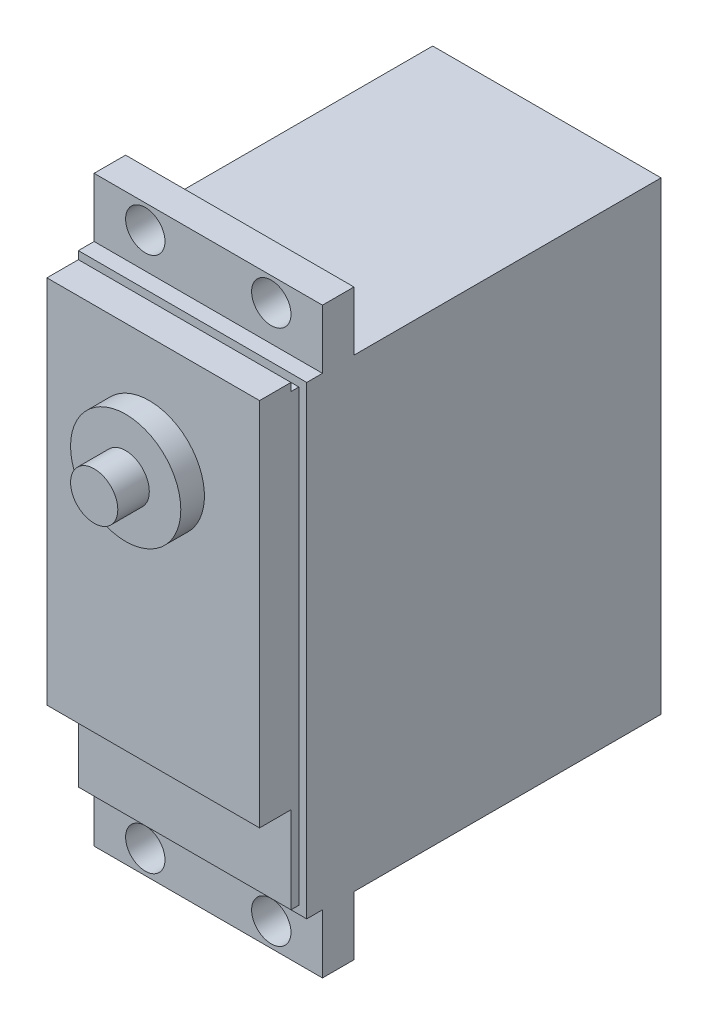
ISO-10303-21;
HEADER;
FILE_DESCRIPTION(('STEP AP214'),'2;1');
FILE_NAME('part.step','',(''),(''),'','','');
FILE_SCHEMA(('AUTOMOTIVE_DESIGN { 1 0 10303 214 1 1 1 1 }'));
ENDSEC;
DATA;
#1=APPLICATION_CONTEXT('core data for automotive mechanical design processes');
#2=APPLICATION_PROTOCOL_DEFINITION('international standard','automotive_design',2000,#1);
#3=PRODUCT_CONTEXT('',#1,'mechanical');
#4=PRODUCT('Part','Part','',(#3));
#5=PRODUCT_RELATED_PRODUCT_CATEGORY('part','',(#4));
#6=PRODUCT_DEFINITION_FORMATION('','',#4);
#7=PRODUCT_DEFINITION_CONTEXT('part definition',#1,'design');
#8=PRODUCT_DEFINITION('design','',#6,#7);
#9=PRODUCT_DEFINITION_SHAPE('','',#8);
#10=(LENGTH_UNIT() NAMED_UNIT(*) SI_UNIT(.MILLI.,.METRE.));
#11=(NAMED_UNIT(*) PLANE_ANGLE_UNIT() SI_UNIT($,.RADIAN.));
#12=(NAMED_UNIT(*) SI_UNIT($,.STERADIAN.) SOLID_ANGLE_UNIT());
#13=UNCERTAINTY_MEASURE_WITH_UNIT(LENGTH_MEASURE(1.E-05),#10,'distance_accuracy_value','');
#14=(GEOMETRIC_REPRESENTATION_CONTEXT(3) GLOBAL_UNCERTAINTY_ASSIGNED_CONTEXT((#13)) GLOBAL_UNIT_ASSIGNED_CONTEXT((#10,
#11,#12)) REPRESENTATION_CONTEXT('',''));
#15=CARTESIAN_POINT('',(0.,0.,0.));
#16=DIRECTION('',(0.,0.,1.));
#17=DIRECTION('',(1.,0.,0.));
#18=AXIS2_PLACEMENT_3D('',#15,#16,#17);
#19=CARTESIAN_POINT('',(0.,0.,45.));
#20=DIRECTION('',(0.,0.,1.));
#21=DIRECTION('',(1.,0.,0.));
#22=AXIS2_PLACEMENT_3D('',#19,#20,#21);
#23=PLANE('',#22);
#24=DIRECTION('',(0.,-1.,0.));
#25=VECTOR('',#24,1.);
#26=CARTESIAN_POINT('',(-59.1299970676006,19.3990717863914,45.));
#27=LINE('',#26,#25);
#28=CARTESIAN_POINT('',(-59.1299970676006,19.3990717863914,45.));
#29=VERTEX_POINT('',#28);
#30=CARTESIAN_POINT('',(-59.1299970676006,-39.6009282136086,45.));
#31=VERTEX_POINT('',#30);
#32=EDGE_CURVE('E228',#29,#31,#27,.T.);
#33=ORIENTED_EDGE('',*,*,#32,.T.);
#34=DIRECTION('',(1.,0.,0.));
#35=VECTOR('',#34,1.);
#36=CARTESIAN_POINT('',(-59.1299970676006,-39.6009282136086,45.));
#37=LINE('',#36,#35);
#38=CARTESIAN_POINT('',(-30.1299970676006,-39.6009282136086,45.));
#39=VERTEX_POINT('',#38);
#40=EDGE_CURVE('E231',#31,#39,#37,.T.);
#41=ORIENTED_EDGE('',*,*,#40,.T.);
#42=DIRECTION('',(0.,1.,0.));
#43=VECTOR('',#42,1.);
#44=CARTESIAN_POINT('',(-30.1299970676006,19.3990717863914,45.));
#45=LINE('',#44,#43);
#46=CARTESIAN_POINT('',(-30.1299970676006,19.3990717863914,45.));
#47=VERTEX_POINT('',#46);
#48=EDGE_CURVE('E234',#39,#47,#45,.T.);
#49=ORIENTED_EDGE('',*,*,#48,.T.);
#50=DIRECTION('',(-1.,0.,0.));
#51=VECTOR('',#50,1.);
#52=CARTESIAN_POINT('',(-59.1299970676006,19.3990717863914,45.));
#53=LINE('',#52,#51);
#54=EDGE_CURVE('E236',#47,#29,#53,.T.);
#55=ORIENTED_EDGE('',*,*,#54,.T.);
#56=EDGE_LOOP('',(#33,#41,#49,#55));
#57=FACE_BOUND('',#56,.T.);
#58=DIRECTION('',(1.,0.,0.));
#59=VECTOR('',#58,1.);
#60=CARTESIAN_POINT('',(-58.1299970676006,-38.6009282136086,45.));
#61=LINE('',#60,#59);
#62=CARTESIAN_POINT('',(-58.1299970676006,-38.6009282136086,45.));
#63=VERTEX_POINT('',#62);
#64=CARTESIAN_POINT('',(-31.1299970676006,-38.6009282136086,45.));
#65=VERTEX_POINT('',#64);
#66=EDGE_CURVE('E196',#63,#65,#61,.T.);
#67=ORIENTED_EDGE('',*,*,#66,.F.);
#68=DIRECTION('',(0.,-1.,0.));
#69=VECTOR('',#68,1.);
#70=CARTESIAN_POINT('',(-58.1299970676006,18.3990717863914,45.));
#71=LINE('',#70,#69);
#72=CARTESIAN_POINT('',(-58.1299970676006,18.3990717863914,45.));
#73=VERTEX_POINT('',#72);
#74=EDGE_CURVE('E194',#73,#63,#71,.T.);
#75=ORIENTED_EDGE('',*,*,#74,.F.);
#76=DIRECTION('',(-1.,0.,0.));
#77=VECTOR('',#76,1.);
#78=CARTESIAN_POINT('',(-58.1299970676006,18.3990717863914,45.));
#79=LINE('',#78,#77);
#80=CARTESIAN_POINT('',(-31.1299970676006,18.3990717863914,45.));
#81=VERTEX_POINT('',#80);
#82=EDGE_CURVE('E220',#81,#73,#79,.T.);
#83=ORIENTED_EDGE('',*,*,#82,.F.);
#84=DIRECTION('',(0.,1.,0.));
#85=VECTOR('',#84,1.);
#86=CARTESIAN_POINT('',(-31.1299970676006,18.3990717863914,45.));
#87=LINE('',#86,#85);
#88=EDGE_CURVE('E218',#65,#81,#87,.T.);
#89=ORIENTED_EDGE('',*,*,#88,.F.);
#90=EDGE_LOOP('',(#67,#75,#83,#89));
#91=FACE_BOUND('',#90,.T.);
#92=ADVANCED_FACE('F32',(#57,#91),#23,.T.);
#93=CARTESIAN_POINT('',(0.,0.,43.));
#94=DIRECTION('',(0.,0.,1.));
#95=DIRECTION('',(1.,0.,0.));
#96=AXIS2_PLACEMENT_3D('',#93,#94,#95);
#97=PLANE('',#96);
#98=CARTESIAN_POINT('',(-52.6299970676006,23.8990717863912,43.));
#99=DIRECTION('',(0.,0.,1.));
#100=DIRECTION('',(1.,0.,0.));
#101=AXIS2_PLACEMENT_3D('',#98,#99,#100);
#102=CIRCLE('',#101,2.5);
#103=CARTESIAN_POINT('',(-50.1299970676006,23.8990717863912,43.));
#104=VERTEX_POINT('',#103);
#105=EDGE_CURVE('E494',#104,#104,#102,.T.);
#106=ORIENTED_EDGE('',*,*,#105,.F.);
#107=EDGE_LOOP('',(#106));
#108=FACE_BOUND('',#107,.T.);
#109=CARTESIAN_POINT('',(-36.6299970676006,23.8990717863914,43.));
#110=DIRECTION('',(0.,0.,1.));
#111=DIRECTION('',(1.,0.,0.));
#112=AXIS2_PLACEMENT_3D('',#109,#110,#111);
#113=CIRCLE('',#112,2.5);
#114=CARTESIAN_POINT('',(-34.1299970676006,23.8990717863914,43.));
#115=VERTEX_POINT('',#114);
#116=EDGE_CURVE('E486',#115,#115,#113,.T.);
#117=ORIENTED_EDGE('',*,*,#116,.F.);
#118=EDGE_LOOP('',(#117));
#119=FACE_BOUND('',#118,.T.);
#120=DIRECTION('',(-1.,0.,0.));
#121=VECTOR('',#120,1.);
#122=CARTESIAN_POINT('',(-59.1299970676006,19.3990717863914,43.));
#123=LINE('',#122,#121);
#124=CARTESIAN_POINT('',(-30.1299970676006,19.3990717863914,43.));
#125=VERTEX_POINT('',#124);
#126=CARTESIAN_POINT('',(-59.1299970676006,19.3990717863914,43.));
#127=VERTEX_POINT('',#126);
#128=EDGE_CURVE('E232',#125,#127,#123,.T.);
#129=ORIENTED_EDGE('',*,*,#128,.F.);
#130=DIRECTION('',(0.,1.,0.));
#131=VECTOR('',#130,1.);
#132=CARTESIAN_POINT('',(-30.1299970676006,19.3990717863914,43.));
#133=LINE('',#132,#131);
#134=CARTESIAN_POINT('',(-30.1299970676006,26.8990717863914,43.));
#135=VERTEX_POINT('',#134);
#136=EDGE_CURVE('E247',#125,#135,#133,.T.);
#137=ORIENTED_EDGE('',*,*,#136,.T.);
#138=DIRECTION('',(-1.,0.,0.));
#139=VECTOR('',#138,1.);
#140=CARTESIAN_POINT('',(-59.1299970676006,26.8990717863914,43.));
#141=LINE('',#140,#139);
#142=CARTESIAN_POINT('',(-59.1299970676006,26.8990717863914,43.));
#143=VERTEX_POINT('',#142);
#144=EDGE_CURVE('E421',#135,#143,#141,.T.);
#145=ORIENTED_EDGE('',*,*,#144,.T.);
#146=DIRECTION('',(0.,-1.,0.));
#147=VECTOR('',#146,1.);
#148=CARTESIAN_POINT('',(-59.1299970676006,19.3990717863914,43.));
#149=LINE('',#148,#147);
#150=EDGE_CURVE('E400',#143,#127,#149,.T.);
#151=ORIENTED_EDGE('',*,*,#150,.T.);
#152=EDGE_LOOP('',(#129,#137,#145,#151));
#153=FACE_BOUND('',#152,.T.);
#154=ADVANCED_FACE('F329',(#108,#119,#153),#97,.T.);
#155=CARTESIAN_POINT('',(-59.1299970676006,19.3990717863914,43.));
#156=DIRECTION('',(1.,0.,0.));
#157=DIRECTION('',(0.,0.,-1.));
#158=AXIS2_PLACEMENT_3D('',#155,#156,#157);
#159=PLANE('',#158);
#160=DIRECTION('',(0.,0.,-1.));
#161=VECTOR('',#160,1.);
#162=CARTESIAN_POINT('',(-59.1299970676006,-39.6009282136086,43.));
#163=LINE('',#162,#161);
#164=CARTESIAN_POINT('',(-59.1299970676006,-39.6009282136086,39.));
#165=VERTEX_POINT('',#164);
#166=CARTESIAN_POINT('',(-59.1299970676006,-39.6009282136086,0.));
#167=VERTEX_POINT('',#166);
#168=EDGE_CURVE('E390',#165,#167,#163,.T.);
#169=ORIENTED_EDGE('',*,*,#168,.F.);
#170=DIRECTION('',(0.,-1.,0.));
#171=VECTOR('',#170,1.);
#172=CARTESIAN_POINT('',(-59.1299970676006,-47.1009282136086,39.));
#173=LINE('',#172,#171);
#174=CARTESIAN_POINT('',(-59.1299970676006,-47.1009282136086,39.));
#175=VERTEX_POINT('',#174);
#176=EDGE_CURVE('E433',#165,#175,#173,.T.);
#177=ORIENTED_EDGE('',*,*,#176,.T.);
#178=DIRECTION('',(0.,0.,1.));
#179=VECTOR('',#178,1.);
#180=CARTESIAN_POINT('',(-59.1299970676006,-47.1009282136086,39.));
#181=LINE('',#180,#179);
#182=CARTESIAN_POINT('',(-59.1299970676006,-47.1009282136086,43.));
#183=VERTEX_POINT('',#182);
#184=EDGE_CURVE('E441',#175,#183,#181,.T.);
#185=ORIENTED_EDGE('',*,*,#184,.T.);
#186=CARTESIAN_POINT('',(-59.1299970676006,-39.6009282136086,43.));
#187=VERTEX_POINT('',#186);
#188=EDGE_CURVE('E403',#187,#183,#149,.T.);
#189=ORIENTED_EDGE('',*,*,#188,.F.);
#190=DIRECTION('',(0.,0.,-1.));
#191=VECTOR('',#190,1.);
#192=CARTESIAN_POINT('',(-59.1299970676006,-39.6009282136086,45.));
#193=LINE('',#192,#191);
#194=EDGE_CURVE('E253',#31,#187,#193,.T.);
#195=ORIENTED_EDGE('',*,*,#194,.F.);
#196=ORIENTED_EDGE('',*,*,#32,.F.);
#197=DIRECTION('',(0.,0.,-1.));
#198=VECTOR('',#197,1.);
#199=CARTESIAN_POINT('',(-59.1299970676006,19.3990717863914,45.));
#200=LINE('',#199,#198);
#201=EDGE_CURVE('E238',#29,#127,#200,.T.);
#202=ORIENTED_EDGE('',*,*,#201,.T.);
#203=ORIENTED_EDGE('',*,*,#150,.F.);
#204=DIRECTION('',(0.,0.,1.));
#205=VECTOR('',#204,1.);
#206=CARTESIAN_POINT('',(-59.1299970676006,26.8990717863914,39.));
#207=LINE('',#206,#205);
#208=CARTESIAN_POINT('',(-59.1299970676006,26.8990717863914,39.));
#209=VERTEX_POINT('',#208);
#210=EDGE_CURVE('E429',#209,#143,#207,.T.);
#211=ORIENTED_EDGE('',*,*,#210,.F.);
#212=CARTESIAN_POINT('',(-59.1299970676006,19.3990717863914,39.));
#213=VERTEX_POINT('',#212);
#214=EDGE_CURVE('E435',#209,#213,#173,.T.);
#215=ORIENTED_EDGE('',*,*,#214,.T.);
#216=DIRECTION('',(0.,0.,-1.));
#217=VECTOR('',#216,1.);
#218=CARTESIAN_POINT('',(-59.1299970676006,19.3990717863914,43.));
#219=LINE('',#218,#217);
#220=CARTESIAN_POINT('',(-59.1299970676006,19.3990717863914,0.));
#221=VERTEX_POINT('',#220);
#222=EDGE_CURVE('E394',#213,#221,#219,.T.);
#223=ORIENTED_EDGE('',*,*,#222,.T.);
#224=DIRECTION('',(0.,-1.,0.));
#225=VECTOR('',#224,1.);
#226=CARTESIAN_POINT('',(-59.1299970676006,19.3990717863914,0.));
#227=LINE('',#226,#225);
#228=EDGE_CURVE('E410',#221,#167,#227,.T.);
#229=ORIENTED_EDGE('',*,*,#228,.T.);
#230=EDGE_LOOP('',(#169,#177,#185,#189,#195,#196,#202,#203,#211,#215,#223,#229));
#231=FACE_BOUND('',#230,.T.);
#232=ADVANCED_FACE('F34',(#231),#159,.F.);
#233=CARTESIAN_POINT('',(-59.1299970676006,-39.6009282136086,43.));
#234=DIRECTION('',(0.,1.,0.));
#235=DIRECTION('',(0.,0.,1.));
#236=AXIS2_PLACEMENT_3D('',#233,#234,#235);
#237=PLANE('',#236);
#238=DIRECTION('',(0.,0.,-1.));
#239=VECTOR('',#238,1.);
#240=CARTESIAN_POINT('',(-30.1299970676006,-39.6009282136086,43.));
#241=LINE('',#240,#239);
#242=CARTESIAN_POINT('',(-30.1299970676006,-39.6009282136086,39.));
#243=VERTEX_POINT('',#242);
#244=CARTESIAN_POINT('',(-30.1299970676006,-39.6009282136086,0.));
#245=VERTEX_POINT('',#244);
#246=EDGE_CURVE('E382',#243,#245,#241,.T.);
#247=ORIENTED_EDGE('',*,*,#246,.F.);
#248=DIRECTION('',(-1.,0.,0.));
#249=VECTOR('',#248,1.);
#250=CARTESIAN_POINT('',(-59.1299970676006,-39.6009282136086,39.));
#251=LINE('',#250,#249);
#252=EDGE_CURVE('E383',#243,#165,#251,.T.);
#253=ORIENTED_EDGE('',*,*,#252,.T.);
#254=ORIENTED_EDGE('',*,*,#168,.T.);
#255=DIRECTION('',(1.,0.,0.));
#256=VECTOR('',#255,1.);
#257=CARTESIAN_POINT('',(-59.1299970676006,-39.6009282136086,0.));
#258=LINE('',#257,#256);
#259=EDGE_CURVE('E386',#167,#245,#258,.T.);
#260=ORIENTED_EDGE('',*,*,#259,.T.);
#261=EDGE_LOOP('',(#247,#253,#254,#260));
#262=FACE_BOUND('',#261,.T.);
#263=ADVANCED_FACE('F371',(#262),#237,.F.);
#264=CARTESIAN_POINT('',(-30.1299970676006,19.3990717863914,43.));
#265=DIRECTION('',(-1.,0.,0.));
#266=DIRECTION('',(0.,0.,1.));
#267=AXIS2_PLACEMENT_3D('',#264,#265,#266);
#268=PLANE('',#267);
#269=DIRECTION('',(0.,0.,-1.));
#270=VECTOR('',#269,1.);
#271=CARTESIAN_POINT('',(-30.1299970676006,19.3990717863914,43.));
#272=LINE('',#271,#270);
#273=CARTESIAN_POINT('',(-30.1299970676006,19.3990717863914,39.));
#274=VERTEX_POINT('',#273);
#275=CARTESIAN_POINT('',(-30.1299970676006,19.3990717863914,0.));
#276=VERTEX_POINT('',#275);
#277=EDGE_CURVE('E391',#274,#276,#272,.T.);
#278=ORIENTED_EDGE('',*,*,#277,.F.);
#279=DIRECTION('',(0.,1.,0.));
#280=VECTOR('',#279,1.);
#281=CARTESIAN_POINT('',(-30.1299970676006,-47.1009282136086,39.));
#282=LINE('',#281,#280);
#283=CARTESIAN_POINT('',(-30.1299970676006,26.8990717863914,39.));
#284=VERTEX_POINT('',#283);
#285=EDGE_CURVE('E426',#274,#284,#282,.T.);
#286=ORIENTED_EDGE('',*,*,#285,.T.);
#287=DIRECTION('',(0.,0.,1.));
#288=VECTOR('',#287,1.);
#289=CARTESIAN_POINT('',(-30.1299970676006,26.8990717863914,39.));
#290=LINE('',#289,#288);
#291=EDGE_CURVE('E424',#284,#135,#290,.T.);
#292=ORIENTED_EDGE('',*,*,#291,.T.);
#293=ORIENTED_EDGE('',*,*,#136,.F.);
#294=DIRECTION('',(0.,0.,-1.));
#295=VECTOR('',#294,1.);
#296=CARTESIAN_POINT('',(-30.1299970676006,19.3990717863914,45.));
#297=LINE('',#296,#295);
#298=EDGE_CURVE('E254',#47,#125,#297,.T.);
#299=ORIENTED_EDGE('',*,*,#298,.F.);
#300=ORIENTED_EDGE('',*,*,#48,.F.);
#301=DIRECTION('',(0.,0.,-1.));
#302=VECTOR('',#301,1.);
#303=CARTESIAN_POINT('',(-30.1299970676006,-39.6009282136086,45.));
#304=LINE('',#303,#302);
#305=CARTESIAN_POINT('',(-30.1299970676006,-39.6009282136086,43.));
#306=VERTEX_POINT('',#305);
#307=EDGE_CURVE('E250',#39,#306,#304,.T.);
#308=ORIENTED_EDGE('',*,*,#307,.T.);
#309=CARTESIAN_POINT('',(-30.1299970676006,-47.1009282136086,43.));
#310=VERTEX_POINT('',#309);
#311=EDGE_CURVE('E413',#310,#306,#133,.T.);
#312=ORIENTED_EDGE('',*,*,#311,.F.);
#313=DIRECTION('',(0.,0.,1.));
#314=VECTOR('',#313,1.);
#315=CARTESIAN_POINT('',(-30.1299970676006,-47.1009282136086,39.));
#316=LINE('',#315,#314);
#317=CARTESIAN_POINT('',(-30.1299970676006,-47.1009282136086,39.));
#318=VERTEX_POINT('',#317);
#319=EDGE_CURVE('E430',#318,#310,#316,.T.);
#320=ORIENTED_EDGE('',*,*,#319,.F.);
#321=EDGE_CURVE('E447',#318,#243,#282,.T.);
#322=ORIENTED_EDGE('',*,*,#321,.T.);
#323=ORIENTED_EDGE('',*,*,#246,.T.);
#324=DIRECTION('',(0.,1.,0.));
#325=VECTOR('',#324,1.);
#326=CARTESIAN_POINT('',(-30.1299970676006,19.3990717863914,0.));
#327=LINE('',#326,#325);
#328=EDGE_CURVE('E461',#245,#276,#327,.T.);
#329=ORIENTED_EDGE('',*,*,#328,.T.);
#330=EDGE_LOOP('',(#278,#286,#292,#293,#299,#300,#308,#312,#320,#322,#323,#329));
#331=FACE_BOUND('',#330,.T.);
#332=ADVANCED_FACE('F368',(#331),#268,.F.);
#333=CARTESIAN_POINT('',(-59.1299970676006,19.3990717863914,43.));
#334=DIRECTION('',(0.,-1.,0.));
#335=DIRECTION('',(0.,0.,-1.));
#336=AXIS2_PLACEMENT_3D('',#333,#334,#335);
#337=PLANE('',#336);
#338=ORIENTED_EDGE('',*,*,#222,.F.);
#339=DIRECTION('',(1.,0.,0.));
#340=VECTOR('',#339,1.);
#341=CARTESIAN_POINT('',(-59.1299970676006,19.3990717863914,39.));
#342=LINE('',#341,#340);
#343=EDGE_CURVE('E40',#213,#274,#342,.T.);
#344=ORIENTED_EDGE('',*,*,#343,.T.);
#345=ORIENTED_EDGE('',*,*,#277,.T.);
#346=DIRECTION('',(-1.,0.,0.));
#347=VECTOR('',#346,1.);
#348=CARTESIAN_POINT('',(-59.1299970676006,19.3990717863914,0.));
#349=LINE('',#348,#347);
#350=EDGE_CURVE('E459',#276,#221,#349,.T.);
#351=ORIENTED_EDGE('',*,*,#350,.T.);
#352=EDGE_LOOP('',(#338,#344,#345,#351));
#353=FACE_BOUND('',#352,.T.);
#354=ADVANCED_FACE('F361',(#353),#337,.F.);
#355=CARTESIAN_POINT('',(-36.6299970675999,-44.1009282136086,43.));
#356=DIRECTION('',(0.,0.,1.));
#357=DIRECTION('',(1.,0.,0.));
#358=AXIS2_PLACEMENT_3D('',#355,#356,#357);
#359=CIRCLE('',#358,2.5);
#360=CARTESIAN_POINT('',(-34.1299970675999,-44.1009282136086,43.));
#361=VERTEX_POINT('',#360);
#362=EDGE_CURVE('E662',#361,#361,#359,.T.);
#363=ORIENTED_EDGE('',*,*,#362,.F.);
#364=EDGE_LOOP('',(#363));
#365=FACE_BOUND('',#364,.T.);
#366=CARTESIAN_POINT('',(-52.6299970675999,-44.1009282136088,43.));
#367=DIRECTION('',(0.,0.,1.));
#368=DIRECTION('',(1.,0.,0.));
#369=AXIS2_PLACEMENT_3D('',#366,#367,#368);
#370=CIRCLE('',#369,2.5);
#371=CARTESIAN_POINT('',(-50.1299970675999,-44.1009282136088,43.));
#372=VERTEX_POINT('',#371);
#373=EDGE_CURVE('E664',#372,#372,#370,.T.);
#374=ORIENTED_EDGE('',*,*,#373,.F.);
#375=EDGE_LOOP('',(#374));
#376=FACE_BOUND('',#375,.T.);
#377=DIRECTION('',(1.,0.,0.));
#378=VECTOR('',#377,1.);
#379=CARTESIAN_POINT('',(-59.1299970676006,-39.6009282136086,43.));
#380=LINE('',#379,#378);
#381=EDGE_CURVE('E227',#187,#306,#380,.T.);
#382=ORIENTED_EDGE('',*,*,#381,.F.);
#383=ORIENTED_EDGE('',*,*,#188,.T.);
#384=DIRECTION('',(1.,0.,0.));
#385=VECTOR('',#384,1.);
#386=CARTESIAN_POINT('',(-59.1299970676006,-47.1009282136086,43.));
#387=LINE('',#386,#385);
#388=EDGE_CURVE('E259',#183,#310,#387,.T.);
#389=ORIENTED_EDGE('',*,*,#388,.T.);
#390=ORIENTED_EDGE('',*,*,#311,.T.);
#391=EDGE_LOOP('',(#382,#383,#389,#390));
#392=FACE_BOUND('',#391,.T.);
#393=ADVANCED_FACE('F337',(#365,#376,#392),#97,.T.);
#394=CARTESIAN_POINT('',(0.,0.,0.));
#395=DIRECTION('',(0.,0.,1.));
#396=DIRECTION('',(1.,0.,0.));
#397=AXIS2_PLACEMENT_3D('',#394,#395,#396);
#398=PLANE('',#397);
#399=ORIENTED_EDGE('',*,*,#228,.F.);
#400=ORIENTED_EDGE('',*,*,#350,.F.);
#401=ORIENTED_EDGE('',*,*,#328,.F.);
#402=ORIENTED_EDGE('',*,*,#259,.F.);
#403=EDGE_LOOP('',(#399,#400,#401,#402));
#404=FACE_BOUND('',#403,.T.);
#405=ADVANCED_FACE('F355',(#404),#398,.F.);
#406=CARTESIAN_POINT('',(-59.1299970676006,26.8990717863914,39.));
#407=DIRECTION('',(0.,1.,0.));
#408=DIRECTION('',(0.,0.,1.));
#409=AXIS2_PLACEMENT_3D('',#406,#407,#408);
#410=PLANE('',#409);
#411=ORIENTED_EDGE('',*,*,#144,.F.);
#412=ORIENTED_EDGE('',*,*,#291,.F.);
#413=DIRECTION('',(-1.,0.,0.));
#414=VECTOR('',#413,1.);
#415=CARTESIAN_POINT('',(-59.1299970676006,26.8990717863914,39.));
#416=LINE('',#415,#414);
#417=EDGE_CURVE('E443',#284,#209,#416,.T.);
#418=ORIENTED_EDGE('',*,*,#417,.T.);
#419=ORIENTED_EDGE('',*,*,#210,.T.);
#420=EDGE_LOOP('',(#411,#412,#418,#419));
#421=FACE_BOUND('',#420,.T.);
#422=ADVANCED_FACE('F352',(#421),#410,.T.);
#423=CARTESIAN_POINT('',(0.,0.,39.));
#424=DIRECTION('',(0.,0.,-1.));
#425=DIRECTION('',(-1.,0.,0.));
#426=AXIS2_PLACEMENT_3D('',#423,#424,#425);
#427=PLANE('',#426);
#428=CARTESIAN_POINT('',(-52.6299970676006,23.8990717863912,39.));
#429=DIRECTION('',(0.,0.,1.));
#430=DIRECTION('',(1.,0.,0.));
#431=AXIS2_PLACEMENT_3D('',#428,#429,#430);
#432=CIRCLE('',#431,2.5);
#433=CARTESIAN_POINT('',(-50.1299970676006,23.8990717863912,39.));
#434=VERTEX_POINT('',#433);
#435=EDGE_CURVE('E480',#434,#434,#432,.T.);
#436=ORIENTED_EDGE('',*,*,#435,.T.);
#437=EDGE_LOOP('',(#436));
#438=FACE_BOUND('',#437,.T.);
#439=CARTESIAN_POINT('',(-36.6299970676006,23.8990717863914,39.));
#440=DIRECTION('',(0.,0.,1.));
#441=DIRECTION('',(1.,0.,0.));
#442=AXIS2_PLACEMENT_3D('',#439,#440,#441);
#443=CIRCLE('',#442,2.5);
#444=CARTESIAN_POINT('',(-34.1299970676006,23.8990717863914,39.));
#445=VERTEX_POINT('',#444);
#446=EDGE_CURVE('E483',#445,#445,#443,.T.);
#447=ORIENTED_EDGE('',*,*,#446,.T.);
#448=EDGE_LOOP('',(#447));
#449=FACE_BOUND('',#448,.T.);
#450=ORIENTED_EDGE('',*,*,#343,.F.);
#451=ORIENTED_EDGE('',*,*,#214,.F.);
#452=ORIENTED_EDGE('',*,*,#417,.F.);
#453=ORIENTED_EDGE('',*,*,#285,.F.);
#454=EDGE_LOOP('',(#450,#451,#452,#453));
#455=FACE_BOUND('',#454,.T.);
#456=ADVANCED_FACE('F350',(#438,#449,#455),#427,.T.);
#457=CARTESIAN_POINT('',(-36.6299970675999,-44.1009282136086,39.));
#458=DIRECTION('',(0.,0.,1.));
#459=DIRECTION('',(1.,0.,0.));
#460=AXIS2_PLACEMENT_3D('',#457,#458,#459);
#461=CIRCLE('',#460,2.5);
#462=CARTESIAN_POINT('',(-34.1299970675999,-44.1009282136086,39.));
#463=VERTEX_POINT('',#462);
#464=EDGE_CURVE('E659',#463,#463,#461,.T.);
#465=ORIENTED_EDGE('',*,*,#464,.T.);
#466=EDGE_LOOP('',(#465));
#467=FACE_BOUND('',#466,.T.);
#468=CARTESIAN_POINT('',(-52.6299970675999,-44.1009282136088,39.));
#469=DIRECTION('',(0.,0.,1.));
#470=DIRECTION('',(1.,0.,0.));
#471=AXIS2_PLACEMENT_3D('',#468,#469,#470);
#472=CIRCLE('',#471,2.5);
#473=CARTESIAN_POINT('',(-50.1299970675999,-44.1009282136088,39.));
#474=VERTEX_POINT('',#473);
#475=EDGE_CURVE('E667',#474,#474,#472,.T.);
#476=ORIENTED_EDGE('',*,*,#475,.T.);
#477=EDGE_LOOP('',(#476));
#478=FACE_BOUND('',#477,.T.);
#479=ORIENTED_EDGE('',*,*,#252,.F.);
#480=ORIENTED_EDGE('',*,*,#321,.F.);
#481=DIRECTION('',(1.,0.,0.));
#482=VECTOR('',#481,1.);
#483=CARTESIAN_POINT('',(-59.1299970676006,-47.1009282136086,39.));
#484=LINE('',#483,#482);
#485=EDGE_CURVE('E450',#175,#318,#484,.T.);
#486=ORIENTED_EDGE('',*,*,#485,.F.);
#487=ORIENTED_EDGE('',*,*,#176,.F.);
#488=EDGE_LOOP('',(#479,#480,#486,#487));
#489=FACE_BOUND('',#488,.T.);
#490=ADVANCED_FACE('F347',(#467,#478,#489),#427,.T.);
#491=CARTESIAN_POINT('',(-59.1299970676006,-47.1009282136086,39.));
#492=DIRECTION('',(0.,-1.,0.));
#493=DIRECTION('',(0.,0.,-1.));
#494=AXIS2_PLACEMENT_3D('',#491,#492,#493);
#495=PLANE('',#494);
#496=ORIENTED_EDGE('',*,*,#388,.F.);
#497=ORIENTED_EDGE('',*,*,#184,.F.);
#498=ORIENTED_EDGE('',*,*,#485,.T.);
#499=ORIENTED_EDGE('',*,*,#319,.T.);
#500=EDGE_LOOP('',(#496,#497,#498,#499));
#501=FACE_BOUND('',#500,.T.);
#502=ADVANCED_FACE('F345',(#501),#495,.T.);
#503=CARTESIAN_POINT('',(-59.1299970676006,-39.6009282136086,45.));
#504=DIRECTION('',(0.,1.,0.));
#505=DIRECTION('',(0.,0.,1.));
#506=AXIS2_PLACEMENT_3D('',#503,#504,#505);
#507=PLANE('',#506);
#508=ORIENTED_EDGE('',*,*,#381,.T.);
#509=ORIENTED_EDGE('',*,*,#307,.F.);
#510=ORIENTED_EDGE('',*,*,#40,.F.);
#511=ORIENTED_EDGE('',*,*,#194,.T.);
#512=EDGE_LOOP('',(#508,#509,#510,#511));
#513=FACE_BOUND('',#512,.T.);
#514=ADVANCED_FACE('F341',(#513),#507,.F.);
#515=CARTESIAN_POINT('',(-59.1299970676006,19.3990717863914,45.));
#516=DIRECTION('',(0.,-1.,0.));
#517=DIRECTION('',(0.,0.,-1.));
#518=AXIS2_PLACEMENT_3D('',#515,#516,#517);
#519=PLANE('',#518);
#520=ORIENTED_EDGE('',*,*,#128,.T.);
#521=ORIENTED_EDGE('',*,*,#201,.F.);
#522=ORIENTED_EDGE('',*,*,#54,.F.);
#523=ORIENTED_EDGE('',*,*,#298,.T.);
#524=EDGE_LOOP('',(#520,#521,#522,#523));
#525=FACE_BOUND('',#524,.T.);
#526=ADVANCED_FACE('F326',(#525),#519,.F.);
#527=CARTESIAN_POINT('',(-58.1299970676006,18.3990717863914,46.));
#528=DIRECTION('',(1.,0.,0.));
#529=DIRECTION('',(0.,0.,-1.));
#530=AXIS2_PLACEMENT_3D('',#527,#528,#529);
#531=PLANE('',#530);
#532=ORIENTED_EDGE('',*,*,#74,.T.);
#533=DIRECTION('',(0.,0.,-1.));
#534=VECTOR('',#533,1.);
#535=CARTESIAN_POINT('',(-58.1299970676006,-38.6009282136086,46.));
#536=LINE('',#535,#534);
#537=CARTESIAN_POINT('',(-58.1299970676006,-38.6009282136086,46.));
#538=VERTEX_POINT('',#537);
#539=EDGE_CURVE('E225',#538,#63,#536,.T.);
#540=ORIENTED_EDGE('',*,*,#539,.F.);
#541=DIRECTION('',(0.,-1.,0.));
#542=VECTOR('',#541,1.);
#543=CARTESIAN_POINT('',(-58.1299970676006,18.3990717863914,46.));
#544=LINE('',#543,#542);
#545=CARTESIAN_POINT('',(-58.1299970676006,-27.6009282136086,46.));
#546=VERTEX_POINT('',#545);
#547=EDGE_CURVE('E193',#546,#538,#544,.T.);
#548=ORIENTED_EDGE('',*,*,#547,.F.);
#549=DIRECTION('',(0.,0.,-1.));
#550=VECTOR('',#549,1.);
#551=CARTESIAN_POINT('',(-58.1299970676006,-27.6009282136086,49.99));
#552=LINE('',#551,#550);
#553=CARTESIAN_POINT('',(-58.1299970676006,-27.6009282136086,49.99));
#554=VERTEX_POINT('',#553);
#555=EDGE_CURVE('E173',#554,#546,#552,.T.);
#556=ORIENTED_EDGE('',*,*,#555,.F.);
#557=DIRECTION('',(0.,-1.,0.));
#558=VECTOR('',#557,1.);
#559=CARTESIAN_POINT('',(-58.1299970676006,-27.6009282136086,49.99));
#560=LINE('',#559,#558);
#561=CARTESIAN_POINT('',(-58.1299970676006,19.3990717863914,49.99));
#562=VERTEX_POINT('',#561);
#563=EDGE_CURVE('E179',#562,#554,#560,.T.);
#564=ORIENTED_EDGE('',*,*,#563,.F.);
#565=DIRECTION('',(0.,0.,-1.));
#566=VECTOR('',#565,1.);
#567=CARTESIAN_POINT('',(-58.1299970676006,19.3990717863914,49.99));
#568=LINE('',#567,#566);
#569=CARTESIAN_POINT('',(-58.1299970676006,19.3990717863914,46.));
#570=VERTEX_POINT('',#569);
#571=EDGE_CURVE('E291',#562,#570,#568,.T.);
#572=ORIENTED_EDGE('',*,*,#571,.T.);
#573=DIRECTION('',(0.,-1.,0.));
#574=VECTOR('',#573,1.);
#575=CARTESIAN_POINT('',(-58.1299970676006,-27.6009282136086,46.));
#576=LINE('',#575,#574);
#577=CARTESIAN_POINT('',(-58.1299970676006,18.3990717863914,46.));
#578=VERTEX_POINT('',#577);
#579=EDGE_CURVE('E286',#570,#578,#576,.T.);
#580=ORIENTED_EDGE('',*,*,#579,.T.);
#581=DIRECTION('',(0.,0.,-1.));
#582=VECTOR('',#581,1.);
#583=CARTESIAN_POINT('',(-58.1299970676006,18.3990717863914,46.));
#584=LINE('',#583,#582);
#585=EDGE_CURVE('E209',#578,#73,#584,.T.);
#586=ORIENTED_EDGE('',*,*,#585,.T.);
#587=EDGE_LOOP('',(#532,#540,#548,#556,#564,#572,#580,#586));
#588=FACE_BOUND('',#587,.T.);
#589=ADVANCED_FACE('F191',(#588),#531,.F.);
#590=CARTESIAN_POINT('',(-58.1299970676006,-38.6009282136086,46.));
#591=DIRECTION('',(0.,1.,0.));
#592=DIRECTION('',(0.,0.,1.));
#593=AXIS2_PLACEMENT_3D('',#590,#591,#592);
#594=PLANE('',#593);
#595=ORIENTED_EDGE('',*,*,#66,.T.);
#596=DIRECTION('',(0.,0.,-1.));
#597=VECTOR('',#596,1.);
#598=CARTESIAN_POINT('',(-31.1299970676006,-38.6009282136086,46.));
#599=LINE('',#598,#597);
#600=CARTESIAN_POINT('',(-31.1299970676006,-38.6009282136086,46.));
#601=VERTEX_POINT('',#600);
#602=EDGE_CURVE('E222',#601,#65,#599,.T.);
#603=ORIENTED_EDGE('',*,*,#602,.F.);
#604=DIRECTION('',(1.,0.,0.));
#605=VECTOR('',#604,1.);
#606=CARTESIAN_POINT('',(-58.1299970676006,-38.6009282136086,46.));
#607=LINE('',#606,#605);
#608=EDGE_CURVE('E274',#538,#601,#607,.T.);
#609=ORIENTED_EDGE('',*,*,#608,.F.);
#610=ORIENTED_EDGE('',*,*,#539,.T.);
#611=EDGE_LOOP('',(#595,#603,#609,#610));
#612=FACE_BOUND('',#611,.T.);
#613=ADVANCED_FACE('F317',(#612),#594,.F.);
#614=CARTESIAN_POINT('',(-31.1299970676006,18.3990717863914,46.));
#615=DIRECTION('',(-1.,0.,0.));
#616=DIRECTION('',(0.,-1.,0.));
#617=AXIS2_PLACEMENT_3D('',#614,#615,#616);
#618=PLANE('',#617);
#619=ORIENTED_EDGE('',*,*,#88,.T.);
#620=DIRECTION('',(0.,0.,-1.));
#621=VECTOR('',#620,1.);
#622=CARTESIAN_POINT('',(-31.1299970676006,18.3990717863914,46.));
#623=LINE('',#622,#621);
#624=CARTESIAN_POINT('',(-31.1299970676006,18.3990717863914,46.));
#625=VERTEX_POINT('',#624);
#626=EDGE_CURVE('E55',#625,#81,#623,.T.);
#627=ORIENTED_EDGE('',*,*,#626,.F.);
#628=DIRECTION('',(0.,1.,0.));
#629=VECTOR('',#628,1.);
#630=CARTESIAN_POINT('',(-31.1299970676006,-27.6009282136086,46.));
#631=LINE('',#630,#629);
#632=CARTESIAN_POINT('',(-31.1299970676006,19.3990717863914,46.));
#633=VERTEX_POINT('',#632);
#634=EDGE_CURVE('E278',#625,#633,#631,.T.);
#635=ORIENTED_EDGE('',*,*,#634,.T.);
#636=DIRECTION('',(0.,0.,-1.));
#637=VECTOR('',#636,1.);
#638=CARTESIAN_POINT('',(-31.1299970676006,19.3990717863914,49.99));
#639=LINE('',#638,#637);
#640=CARTESIAN_POINT('',(-31.1299970676006,19.3990717863914,49.99));
#641=VERTEX_POINT('',#640);
#642=EDGE_CURVE('E198',#641,#633,#639,.T.);
#643=ORIENTED_EDGE('',*,*,#642,.F.);
#644=DIRECTION('',(0.,1.,0.));
#645=VECTOR('',#644,1.);
#646=CARTESIAN_POINT('',(-31.1299970676006,-27.6009282136086,49.99));
#647=LINE('',#646,#645);
#648=CARTESIAN_POINT('',(-31.1299970676006,-27.6009282136086,49.99));
#649=VERTEX_POINT('',#648);
#650=EDGE_CURVE('E178',#649,#641,#647,.T.);
#651=ORIENTED_EDGE('',*,*,#650,.F.);
#652=DIRECTION('',(0.,0.,-1.));
#653=VECTOR('',#652,1.);
#654=CARTESIAN_POINT('',(-31.1299970676006,-27.6009282136086,49.99));
#655=LINE('',#654,#653);
#656=CARTESIAN_POINT('',(-31.1299970676006,-27.6009282136086,46.));
#657=VERTEX_POINT('',#656);
#658=EDGE_CURVE('E175',#649,#657,#655,.T.);
#659=ORIENTED_EDGE('',*,*,#658,.T.);
#660=DIRECTION('',(0.,1.,0.));
#661=VECTOR('',#660,1.);
#662=CARTESIAN_POINT('',(-31.1299970676006,18.3990717863914,46.));
#663=LINE('',#662,#661);
#664=EDGE_CURVE('E210',#601,#657,#663,.T.);
#665=ORIENTED_EDGE('',*,*,#664,.F.);
#666=ORIENTED_EDGE('',*,*,#602,.T.);
#667=EDGE_LOOP('',(#619,#627,#635,#643,#651,#659,#665,#666));
#668=FACE_BOUND('',#667,.T.);
#669=ADVANCED_FACE('F287',(#668),#618,.F.);
#670=CARTESIAN_POINT('',(-58.1299970676006,18.3990717863914,46.));
#671=DIRECTION('',(0.,-1.,0.));
#672=DIRECTION('',(0.,0.,-1.));
#673=AXIS2_PLACEMENT_3D('',#670,#671,#672);
#674=PLANE('',#673);
#675=ORIENTED_EDGE('',*,*,#82,.T.);
#676=ORIENTED_EDGE('',*,*,#585,.F.);
#677=DIRECTION('',(-1.,0.,0.));
#678=VECTOR('',#677,1.);
#679=CARTESIAN_POINT('',(-58.1299970676006,18.3990717863914,46.));
#680=LINE('',#679,#678);
#681=EDGE_CURVE('E205',#625,#578,#680,.T.);
#682=ORIENTED_EDGE('',*,*,#681,.F.);
#683=ORIENTED_EDGE('',*,*,#626,.T.);
#684=EDGE_LOOP('',(#675,#676,#682,#683));
#685=FACE_BOUND('',#684,.T.);
#686=ADVANCED_FACE('F324',(#685),#674,.F.);
#687=CARTESIAN_POINT('',(0.,0.,46.));
#688=DIRECTION('',(0.,0.,1.));
#689=DIRECTION('',(1.,0.,0.));
#690=AXIS2_PLACEMENT_3D('',#687,#688,#689);
#691=PLANE('',#690);
#692=DIRECTION('',(1.,0.,0.));
#693=VECTOR('',#692,1.);
#694=CARTESIAN_POINT('',(-58.1299970676006,-27.6009282136086,46.));
#695=LINE('',#694,#693);
#696=EDGE_CURVE('E47',#546,#657,#695,.T.);
#697=ORIENTED_EDGE('',*,*,#696,.F.);
#698=ORIENTED_EDGE('',*,*,#547,.T.);
#699=ORIENTED_EDGE('',*,*,#608,.T.);
#700=ORIENTED_EDGE('',*,*,#664,.T.);
#701=EDGE_LOOP('',(#697,#698,#699,#700));
#702=FACE_BOUND('',#701,.T.);
#703=ADVANCED_FACE('F284',(#702),#691,.T.);
#704=CARTESIAN_POINT('',(-58.1299970676006,-27.6009282136086,49.99));
#705=DIRECTION('',(0.,1.,0.));
#706=DIRECTION('',(-1.,0.,0.));
#707=AXIS2_PLACEMENT_3D('',#704,#705,#706);
#708=PLANE('',#707);
#709=ORIENTED_EDGE('',*,*,#696,.T.);
#710=ORIENTED_EDGE('',*,*,#658,.F.);
#711=DIRECTION('',(1.,0.,0.));
#712=VECTOR('',#711,1.);
#713=CARTESIAN_POINT('',(-58.1299970676006,-27.6009282136086,49.99));
#714=LINE('',#713,#712);
#715=EDGE_CURVE('E169',#554,#649,#714,.T.);
#716=ORIENTED_EDGE('',*,*,#715,.F.);
#717=ORIENTED_EDGE('',*,*,#555,.T.);
#718=EDGE_LOOP('',(#709,#710,#716,#717));
#719=FACE_BOUND('',#718,.T.);
#720=ADVANCED_FACE('F171',(#719),#708,.F.);
#721=CARTESIAN_POINT('',(-58.1299970676006,19.3990717863914,49.99));
#722=DIRECTION('',(0.,-1.,0.));
#723=DIRECTION('',(0.,0.,-1.));
#724=AXIS2_PLACEMENT_3D('',#721,#722,#723);
#725=PLANE('',#724);
#726=DIRECTION('',(-1.,0.,0.));
#727=VECTOR('',#726,1.);
#728=CARTESIAN_POINT('',(-58.1299970676006,19.3990717863914,46.));
#729=LINE('',#728,#727);
#730=EDGE_CURVE('E188',#633,#570,#729,.T.);
#731=ORIENTED_EDGE('',*,*,#730,.T.);
#732=ORIENTED_EDGE('',*,*,#571,.F.);
#733=DIRECTION('',(-1.,0.,0.));
#734=VECTOR('',#733,1.);
#735=CARTESIAN_POINT('',(-58.1299970676006,19.3990717863914,49.99));
#736=LINE('',#735,#734);
#737=EDGE_CURVE('E184',#641,#562,#736,.T.);
#738=ORIENTED_EDGE('',*,*,#737,.F.);
#739=ORIENTED_EDGE('',*,*,#642,.T.);
#740=EDGE_LOOP('',(#731,#732,#738,#739));
#741=FACE_BOUND('',#740,.T.);
#742=ADVANCED_FACE('F307',(#741),#725,.F.);
#743=CARTESIAN_POINT('',(0.,0.,49.99));
#744=DIRECTION('',(0.,0.,-1.));
#745=DIRECTION('',(-1.,0.,0.));
#746=AXIS2_PLACEMENT_3D('',#743,#744,#745);
#747=PLANE('',#746);
#748=CARTESIAN_POINT('',(-45.1299970676006,5.39907178639136,49.99));
#749=DIRECTION('',(0.,0.,-1.));
#750=DIRECTION('',(-1.,0.,0.));
#751=AXIS2_PLACEMENT_3D('',#748,#749,#750);
#752=CIRCLE('',#751,7.);
#753=CARTESIAN_POINT('',(-52.1299970676006,5.39907178639136,49.99));
#754=VERTEX_POINT('',#753);
#755=EDGE_CURVE('E11',#754,#754,#752,.F.);
#756=ORIENTED_EDGE('',*,*,#755,.F.);
#757=EDGE_LOOP('',(#756));
#758=FACE_BOUND('',#757,.T.);
#759=ORIENTED_EDGE('',*,*,#563,.T.);
#760=ORIENTED_EDGE('',*,*,#715,.T.);
#761=ORIENTED_EDGE('',*,*,#650,.T.);
#762=ORIENTED_EDGE('',*,*,#737,.T.);
#763=EDGE_LOOP('',(#759,#760,#761,#762));
#764=FACE_BOUND('',#763,.T.);
#765=ADVANCED_FACE('F182',(#758,#764),#747,.F.);
#766=CARTESIAN_POINT('',(0.,0.,46.));
#767=DIRECTION('',(0.,0.,-1.));
#768=DIRECTION('',(-1.,0.,0.));
#769=AXIS2_PLACEMENT_3D('',#766,#767,#768);
#770=PLANE('',#769);
#771=ORIENTED_EDGE('',*,*,#634,.F.);
#772=ORIENTED_EDGE('',*,*,#681,.T.);
#773=ORIENTED_EDGE('',*,*,#579,.F.);
#774=ORIENTED_EDGE('',*,*,#730,.F.);
#775=EDGE_LOOP('',(#771,#772,#773,#774));
#776=FACE_BOUND('',#775,.T.);
#777=ADVANCED_FACE('F309',(#776),#770,.T.);
#778=CARTESIAN_POINT('',(-45.1299970676006,5.39907178639136,52.99));
#779=DIRECTION('',(0.,0.,-1.));
#780=DIRECTION('',(-1.,0.,0.));
#781=AXIS2_PLACEMENT_3D('',#778,#779,#780);
#782=CYLINDRICAL_SURFACE('',#781,7.);
#783=CARTESIAN_POINT('',(-45.1299970676006,5.39907178639136,52.99));
#784=DIRECTION('',(0.,0.,1.));
#785=DIRECTION('',(1.,0.,0.));
#786=AXIS2_PLACEMENT_3D('',#783,#784,#785);
#787=CIRCLE('',#786,7.);
#788=CARTESIAN_POINT('',(-38.1299970676006,5.39907178639136,52.99));
#789=VERTEX_POINT('',#788);
#790=EDGE_CURVE('E299',#789,#789,#787,.T.);
#791=ORIENTED_EDGE('',*,*,#790,.F.);
#792=EDGE_LOOP('',(#791));
#793=FACE_BOUND('',#792,.T.);
#794=ORIENTED_EDGE('',*,*,#755,.T.);
#795=EDGE_LOOP('',(#794));
#796=FACE_BOUND('',#795,.T.);
#797=ADVANCED_FACE('F504',(#793,#796),#782,.T.);
#798=CARTESIAN_POINT('',(-45.1299970676006,5.39907178639136,52.99));
#799=DIRECTION('',(0.,0.,1.));
#800=DIRECTION('',(1.,0.,0.));
#801=AXIS2_PLACEMENT_3D('',#798,#799,#800);
#802=PLANE('',#801);
#803=CARTESIAN_POINT('',(-45.1299970676006,5.39907178639136,52.99));
#804=DIRECTION('',(0.,0.,1.));
#805=DIRECTION('',(1.,0.,0.));
#806=AXIS2_PLACEMENT_3D('',#803,#804,#805);
#807=CIRCLE('',#806,3.);
#808=CARTESIAN_POINT('',(-42.1299970676006,5.39907178639136,52.99));
#809=VERTEX_POINT('',#808);
#810=EDGE_CURVE('E485',#809,#809,#807,.T.);
#811=ORIENTED_EDGE('',*,*,#810,.F.);
#812=EDGE_LOOP('',(#811));
#813=FACE_BOUND('',#812,.T.);
#814=ORIENTED_EDGE('',*,*,#790,.T.);
#815=EDGE_LOOP('',(#814));
#816=FACE_BOUND('',#815,.T.);
#817=ADVANCED_FACE('F502',(#813,#816),#802,.T.);
#818=CARTESIAN_POINT('',(-45.1299970676006,5.39907178639136,56.99));
#819=DIRECTION('',(0.,0.,-1.));
#820=DIRECTION('',(-1.,0.,0.));
#821=AXIS2_PLACEMENT_3D('',#818,#819,#820);
#822=CYLINDRICAL_SURFACE('',#821,3.);
#823=CARTESIAN_POINT('',(-45.1299970676006,5.39907178639136,56.99));
#824=DIRECTION('',(0.,0.,1.));
#825=DIRECTION('',(1.,0.,0.));
#826=AXIS2_PLACEMENT_3D('',#823,#824,#825);
#827=CIRCLE('',#826,3.);
#828=CARTESIAN_POINT('',(-42.1299970676006,5.39907178639136,56.99));
#829=VERTEX_POINT('',#828);
#830=EDGE_CURVE('E489',#829,#829,#827,.T.);
#831=ORIENTED_EDGE('',*,*,#830,.F.);
#832=EDGE_LOOP('',(#831));
#833=FACE_BOUND('',#832,.T.);
#834=ORIENTED_EDGE('',*,*,#810,.T.);
#835=EDGE_LOOP('',(#834));
#836=FACE_BOUND('',#835,.T.);
#837=ADVANCED_FACE('F566',(#833,#836),#822,.T.);
#838=CARTESIAN_POINT('',(-45.1299970676006,5.39907178639136,56.99));
#839=DIRECTION('',(0.,0.,1.));
#840=DIRECTION('',(1.,0.,0.));
#841=AXIS2_PLACEMENT_3D('',#838,#839,#840);
#842=PLANE('',#841);
#843=ORIENTED_EDGE('',*,*,#830,.T.);
#844=EDGE_LOOP('',(#843));
#845=FACE_BOUND('',#844,.T.);
#846=ADVANCED_FACE('F575',(#845),#842,.T.);
#847=CARTESIAN_POINT('',(-36.6299970676006,23.8990717863914,39.));
#848=DIRECTION('',(0.,0.,1.));
#849=DIRECTION('',(1.,0.,0.));
#850=AXIS2_PLACEMENT_3D('',#847,#848,#849);
#851=CYLINDRICAL_SURFACE('',#850,2.5);
#852=ORIENTED_EDGE('',*,*,#446,.F.);
#853=EDGE_LOOP('',(#852));
#854=FACE_BOUND('',#853,.T.);
#855=ORIENTED_EDGE('',*,*,#116,.T.);
#856=EDGE_LOOP('',(#855));
#857=FACE_BOUND('',#856,.T.);
#858=ADVANCED_FACE('F585',(#854,#857),#851,.F.);
#859=CARTESIAN_POINT('',(-52.6299970676006,23.8990717863912,39.));
#860=DIRECTION('',(0.,0.,1.));
#861=DIRECTION('',(1.,0.,0.));
#862=AXIS2_PLACEMENT_3D('',#859,#860,#861);
#863=CYLINDRICAL_SURFACE('',#862,2.5);
#864=ORIENTED_EDGE('',*,*,#435,.F.);
#865=EDGE_LOOP('',(#864));
#866=FACE_BOUND('',#865,.T.);
#867=ORIENTED_EDGE('',*,*,#105,.T.);
#868=EDGE_LOOP('',(#867));
#869=FACE_BOUND('',#868,.T.);
#870=ADVANCED_FACE('F623',(#866,#869),#863,.F.);
#871=CARTESIAN_POINT('',(-52.6299970675999,-44.1009282136088,39.));
#872=DIRECTION('',(0.,0.,1.));
#873=DIRECTION('',(1.,0.,0.));
#874=AXIS2_PLACEMENT_3D('',#871,#872,#873);
#875=CYLINDRICAL_SURFACE('',#874,2.5);
#876=ORIENTED_EDGE('',*,*,#475,.F.);
#877=EDGE_LOOP('',(#876));
#878=FACE_BOUND('',#877,.T.);
#879=ORIENTED_EDGE('',*,*,#373,.T.);
#880=EDGE_LOOP('',(#879));
#881=FACE_BOUND('',#880,.T.);
#882=ADVANCED_FACE('F632',(#878,#881),#875,.F.);
#883=CARTESIAN_POINT('',(-36.6299970675999,-44.1009282136086,39.));
#884=DIRECTION('',(0.,0.,1.));
#885=DIRECTION('',(1.,0.,0.));
#886=AXIS2_PLACEMENT_3D('',#883,#884,#885);
#887=CYLINDRICAL_SURFACE('',#886,2.5);
#888=ORIENTED_EDGE('',*,*,#464,.F.);
#889=EDGE_LOOP('',(#888));
#890=FACE_BOUND('',#889,.T.);
#891=ORIENTED_EDGE('',*,*,#362,.T.);
#892=EDGE_LOOP('',(#891));
#893=FACE_BOUND('',#892,.T.);
#894=ADVANCED_FACE('F642',(#890,#893),#887,.F.);
#895=CLOSED_SHELL('',(#92,#154,#232,#263,#332,#354,#393,#405,#422,#456,#490,#502,#514,#526,#589,
#613,#669,#686,#703,#720,#742,#765,#777,#797,#817,#837,#846,#858,#870,#882,#894));
#896=MANIFOLD_SOLID_BREP('B2',#895);
#897=ADVANCED_BREP_SHAPE_REPRESENTATION('',(#18,#896),#14);
#898=SHAPE_DEFINITION_REPRESENTATION(#9,#897);
ENDSEC;
END-ISO-10303-21;
